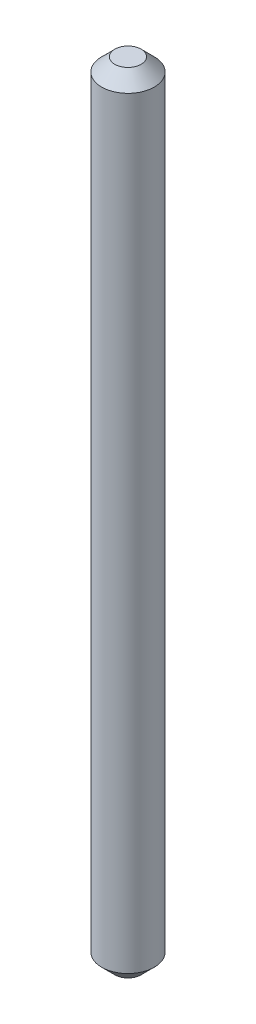
ISO-10303-21;
HEADER;
FILE_DESCRIPTION(('STEP AP214'),'2;1');
FILE_NAME('part.step','',(''),(''),'','','');
FILE_SCHEMA(('AUTOMOTIVE_DESIGN { 1 0 10303 214 1 1 1 1 }'));
ENDSEC;
DATA;
#1=APPLICATION_CONTEXT('core data for automotive mechanical design processes');
#2=APPLICATION_PROTOCOL_DEFINITION('international standard','automotive_design',2000,#1);
#3=PRODUCT_CONTEXT('',#1,'mechanical');
#4=PRODUCT('Part','Part','',(#3));
#5=PRODUCT_RELATED_PRODUCT_CATEGORY('part','',(#4));
#6=PRODUCT_DEFINITION_FORMATION('','',#4);
#7=PRODUCT_DEFINITION_CONTEXT('part definition',#1,'design');
#8=PRODUCT_DEFINITION('design','',#6,#7);
#9=PRODUCT_DEFINITION_SHAPE('','',#8);
#10=(LENGTH_UNIT() NAMED_UNIT(*) SI_UNIT(.MILLI.,.METRE.));
#11=(NAMED_UNIT(*) PLANE_ANGLE_UNIT() SI_UNIT($,.RADIAN.));
#12=(NAMED_UNIT(*) SI_UNIT($,.STERADIAN.) SOLID_ANGLE_UNIT());
#13=UNCERTAINTY_MEASURE_WITH_UNIT(LENGTH_MEASURE(1.E-05),#10,'distance_accuracy_value','');
#14=(GEOMETRIC_REPRESENTATION_CONTEXT(3) GLOBAL_UNCERTAINTY_ASSIGNED_CONTEXT((#13)) GLOBAL_UNIT_ASSIGNED_CONTEXT((#10,
#11,#12)) REPRESENTATION_CONTEXT('',''));
#15=CARTESIAN_POINT('',(0.,0.,0.));
#16=DIRECTION('',(0.,0.,1.));
#17=DIRECTION('',(1.,0.,0.));
#18=AXIS2_PLACEMENT_3D('',#15,#16,#17);
#19=CARTESIAN_POINT('',(0.,15.,0.));
#20=DIRECTION('',(0.,-1.,0.));
#21=DIRECTION('',(0.,0.,-1.));
#22=AXIS2_PLACEMENT_3D('',#19,#20,#21);
#23=CYLINDRICAL_SURFACE('',#22,1.);
#24=CARTESIAN_POINT('',(0.,-14.5,0.));
#25=DIRECTION('',(0.,1.,0.));
#26=DIRECTION('',(0.,0.,1.));
#27=AXIS2_PLACEMENT_3D('',#24,#25,#26);
#28=CIRCLE('',#27,1.);
#29=CARTESIAN_POINT('',(0.,-14.5,1.));
#30=VERTEX_POINT('',#29);
#31=EDGE_CURVE('E61',#30,#30,#28,.T.);
#32=ORIENTED_EDGE('',*,*,#31,.T.);
#33=EDGE_LOOP('',(#32));
#34=FACE_BOUND('',#33,.T.);
#35=CARTESIAN_POINT('',(0.,14.5,0.));
#36=DIRECTION('',(0.,1.,0.));
#37=DIRECTION('',(0.,0.,1.));
#38=AXIS2_PLACEMENT_3D('',#35,#36,#37);
#39=CIRCLE('',#38,1.);
#40=CARTESIAN_POINT('',(0.,14.5,1.));
#41=VERTEX_POINT('',#40);
#42=EDGE_CURVE('E66',#41,#41,#39,.F.);
#43=ORIENTED_EDGE('',*,*,#42,.T.);
#44=EDGE_LOOP('',(#43));
#45=FACE_BOUND('',#44,.T.);
#46=ADVANCED_FACE('F47',(#34,#45),#23,.T.);
#47=CARTESIAN_POINT('',(0.,15.,0.));
#48=DIRECTION('',(0.,1.,0.));
#49=DIRECTION('',(0.,0.,1.));
#50=AXIS2_PLACEMENT_3D('',#47,#48,#49);
#51=PLANE('',#50);
#52=CARTESIAN_POINT('',(0.,15.,0.));
#53=DIRECTION('',(0.,1.,0.));
#54=DIRECTION('',(0.,0.,1.));
#55=AXIS2_PLACEMENT_3D('',#52,#53,#54);
#56=CIRCLE('',#55,0.499999999999997);
#57=CARTESIAN_POINT('',(0.,15.,0.499999999999997));
#58=VERTEX_POINT('',#57);
#59=EDGE_CURVE('E12',#58,#58,#56,.T.);
#60=ORIENTED_EDGE('',*,*,#59,.T.);
#61=EDGE_LOOP('',(#60));
#62=FACE_BOUND('',#61,.T.);
#63=ADVANCED_FACE('F82',(#62),#51,.T.);
#64=CARTESIAN_POINT('',(0.,-15.,0.));
#65=DIRECTION('',(0.,1.,0.));
#66=DIRECTION('',(0.,0.,1.));
#67=AXIS2_PLACEMENT_3D('',#64,#65,#66);
#68=PLANE('',#67);
#69=CARTESIAN_POINT('',(0.,-15.,0.));
#70=DIRECTION('',(0.,1.,0.));
#71=DIRECTION('',(0.,0.,1.));
#72=AXIS2_PLACEMENT_3D('',#69,#70,#71);
#73=CIRCLE('',#72,0.500000000000001);
#74=CARTESIAN_POINT('',(0.,-15.,0.500000000000001));
#75=VERTEX_POINT('',#74);
#76=EDGE_CURVE('E55',#75,#75,#73,.F.);
#77=ORIENTED_EDGE('',*,*,#76,.T.);
#78=EDGE_LOOP('',(#77));
#79=FACE_BOUND('',#78,.T.);
#80=ADVANCED_FACE('F79',(#79),#68,.F.);
#81=CARTESIAN_POINT('',(0.,-14.5,0.));
#82=DIRECTION('',(0.,1.,0.));
#83=DIRECTION('',(0.,0.,1.));
#84=AXIS2_PLACEMENT_3D('',#81,#82,#83);
#85=CONICAL_SURFACE('',#84,1.,0.785398163397451);
#86=ORIENTED_EDGE('',*,*,#76,.F.);
#87=EDGE_LOOP('',(#86));
#88=FACE_BOUND('',#87,.T.);
#89=ORIENTED_EDGE('',*,*,#31,.F.);
#90=EDGE_LOOP('',(#89));
#91=FACE_BOUND('',#90,.T.);
#92=ADVANCED_FACE('F75',(#88,#91),#85,.T.);
#93=CARTESIAN_POINT('',(0.,15.,0.));
#94=DIRECTION('',(0.,-1.,0.));
#95=DIRECTION('',(0.,0.,-1.));
#96=AXIS2_PLACEMENT_3D('',#93,#94,#95);
#97=CONICAL_SURFACE('',#96,0.499999999999997,0.785398163397444);
#98=ORIENTED_EDGE('',*,*,#42,.F.);
#99=EDGE_LOOP('',(#98));
#100=FACE_BOUND('',#99,.T.);
#101=ORIENTED_EDGE('',*,*,#59,.F.);
#102=EDGE_LOOP('',(#101));
#103=FACE_BOUND('',#102,.T.);
#104=ADVANCED_FACE('F49',(#100,#103),#97,.T.);
#105=CLOSED_SHELL('',(#46,#63,#80,#92,#104));
#106=MANIFOLD_SOLID_BREP('B2',#105);
#107=ADVANCED_BREP_SHAPE_REPRESENTATION('',(#18,#106),#14);
#108=SHAPE_DEFINITION_REPRESENTATION(#9,#107);
ENDSEC;
END-ISO-10303-21;
